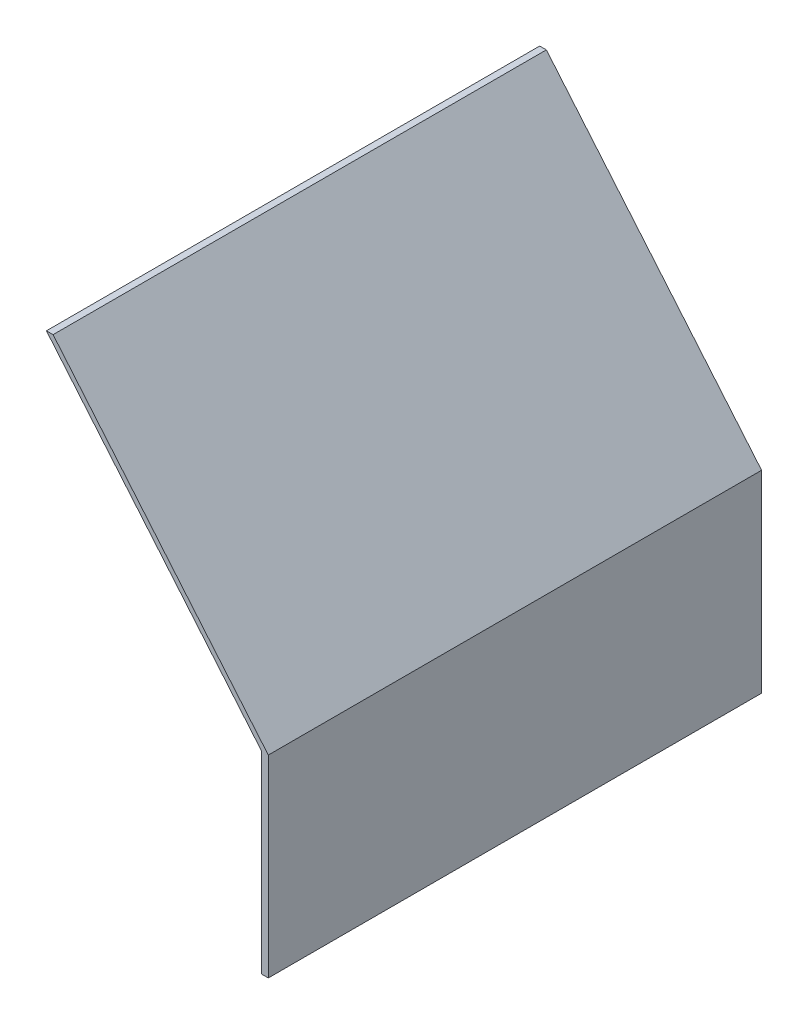
ISO-10303-21;
HEADER;
FILE_DESCRIPTION(('STEP AP214'),'2;1');
FILE_NAME('part.step','',(''),(''),'','','');
FILE_SCHEMA(('AUTOMOTIVE_DESIGN { 1 0 10303 214 1 1 1 1 }'));
ENDSEC;
DATA;
#1=APPLICATION_CONTEXT('core data for automotive mechanical design processes');
#2=APPLICATION_PROTOCOL_DEFINITION('international standard','automotive_design',2000,#1);
#3=PRODUCT_CONTEXT('',#1,'mechanical');
#4=PRODUCT('Part','Part','',(#3));
#5=PRODUCT_RELATED_PRODUCT_CATEGORY('part','',(#4));
#6=PRODUCT_DEFINITION_FORMATION('','',#4);
#7=PRODUCT_DEFINITION_CONTEXT('part definition',#1,'design');
#8=PRODUCT_DEFINITION('design','',#6,#7);
#9=PRODUCT_DEFINITION_SHAPE('','',#8);
#10=(LENGTH_UNIT() NAMED_UNIT(*) SI_UNIT(.MILLI.,.METRE.));
#11=(NAMED_UNIT(*) PLANE_ANGLE_UNIT() SI_UNIT($,.RADIAN.));
#12=(NAMED_UNIT(*) SI_UNIT($,.STERADIAN.) SOLID_ANGLE_UNIT());
#13=UNCERTAINTY_MEASURE_WITH_UNIT(LENGTH_MEASURE(1.E-05),#10,'distance_accuracy_value','');
#14=(GEOMETRIC_REPRESENTATION_CONTEXT(3) GLOBAL_UNCERTAINTY_ASSIGNED_CONTEXT((#13)) GLOBAL_UNIT_ASSIGNED_CONTEXT((#10,
#11,#12)) REPRESENTATION_CONTEXT('',''));
#15=CARTESIAN_POINT('',(0.,0.,0.));
#16=DIRECTION('',(0.,0.,1.));
#17=DIRECTION('',(1.,0.,0.));
#18=AXIS2_PLACEMENT_3D('',#15,#16,#17);
#19=CARTESIAN_POINT('',(0.,43.942,112.268));
#20=DIRECTION('',(-1.,0.,0.));
#21=DIRECTION('',(0.,-1.,0.));
#22=AXIS2_PLACEMENT_3D('',#19,#20,#21);
#23=PLANE('',#22);
#24=DIRECTION('',(0.,1.,0.));
#25=VECTOR('',#24,1.);
#26=CARTESIAN_POINT('',(0.,43.942,0.));
#27=LINE('',#26,#25);
#28=CARTESIAN_POINT('',(0.,0.,0.));
#29=VERTEX_POINT('',#28);
#30=CARTESIAN_POINT('',(0.,43.942,0.));
#31=VERTEX_POINT('',#30);
#32=EDGE_CURVE('E118',#29,#31,#27,.T.);
#33=ORIENTED_EDGE('',*,*,#32,.T.);
#34=DIRECTION('',(0.,0.,-1.));
#35=VECTOR('',#34,1.);
#36=CARTESIAN_POINT('',(0.,43.942,112.268));
#37=LINE('',#36,#35);
#38=CARTESIAN_POINT('',(0.,43.942,112.268));
#39=VERTEX_POINT('',#38);
#40=EDGE_CURVE('E11',#39,#31,#37,.T.);
#41=ORIENTED_EDGE('',*,*,#40,.F.);
#42=DIRECTION('',(0.,1.,0.));
#43=VECTOR('',#42,1.);
#44=CARTESIAN_POINT('',(0.,43.942,112.268));
#45=LINE('',#44,#43);
#46=CARTESIAN_POINT('',(0.,0.,112.268));
#47=VERTEX_POINT('',#46);
#48=EDGE_CURVE('E128',#47,#39,#45,.T.);
#49=ORIENTED_EDGE('',*,*,#48,.F.);
#50=DIRECTION('',(0.,0.,-1.));
#51=VECTOR('',#50,1.);
#52=CARTESIAN_POINT('',(0.,0.,112.268));
#53=LINE('',#52,#51);
#54=EDGE_CURVE('E114',#47,#29,#53,.T.);
#55=ORIENTED_EDGE('',*,*,#54,.T.);
#56=EDGE_LOOP('',(#33,#41,#49,#55));
#57=FACE_BOUND('',#56,.T.);
#58=ADVANCED_FACE('F34',(#57),#23,.F.);
#59=CARTESIAN_POINT('',(-48.9804158581144,102.314586565666,112.268));
#60=DIRECTION('',(-0.766044443118977,-0.64278760968654,0.));
#61=DIRECTION('',(0.64278760968654,-0.766044443118977,0.));
#62=AXIS2_PLACEMENT_3D('',#59,#60,#61);
#63=PLANE('',#62);
#64=DIRECTION('',(-0.64278760968654,0.766044443118977,0.));
#65=VECTOR('',#64,1.);
#66=CARTESIAN_POINT('',(-48.9804158581144,102.314586565666,0.));
#67=LINE('',#66,#65);
#68=CARTESIAN_POINT('',(-48.9804158581144,102.314586565666,0.));
#69=VERTEX_POINT('',#68);
#70=EDGE_CURVE('E121',#31,#69,#67,.T.);
#71=ORIENTED_EDGE('',*,*,#70,.T.);
#72=DIRECTION('',(0.,0.,-1.));
#73=VECTOR('',#72,1.);
#74=CARTESIAN_POINT('',(-48.9804158581144,102.314586565666,112.268));
#75=LINE('',#74,#73);
#76=CARTESIAN_POINT('',(-48.9804158581144,102.314586565666,112.268));
#77=VERTEX_POINT('',#76);
#78=EDGE_CURVE('E42',#77,#69,#75,.T.);
#79=ORIENTED_EDGE('',*,*,#78,.F.);
#80=DIRECTION('',(-0.64278760968654,0.766044443118977,0.));
#81=VECTOR('',#80,1.);
#82=CARTESIAN_POINT('',(-48.9804158581144,102.314586565666,112.268));
#83=LINE('',#82,#81);
#84=EDGE_CURVE('E87',#39,#77,#83,.T.);
#85=ORIENTED_EDGE('',*,*,#84,.F.);
#86=ORIENTED_EDGE('',*,*,#40,.T.);
#87=EDGE_LOOP('',(#71,#79,#85,#86));
#88=FACE_BOUND('',#87,.T.);
#89=ADVANCED_FACE('F152',(#88),#63,.F.);
#90=CARTESIAN_POINT('',(-50.4993358581144,102.314586565666,112.268));
#91=DIRECTION('',(0.,-1.,0.));
#92=DIRECTION('',(1.,0.,0.));
#93=AXIS2_PLACEMENT_3D('',#90,#91,#92);
#94=PLANE('',#93);
#95=DIRECTION('',(-1.,0.,0.));
#96=VECTOR('',#95,1.);
#97=CARTESIAN_POINT('',(-50.4993358581144,102.314586565666,0.));
#98=LINE('',#97,#96);
#99=CARTESIAN_POINT('',(-50.4993358581144,102.314586565666,0.));
#100=VERTEX_POINT('',#99);
#101=EDGE_CURVE('E123',#69,#100,#98,.T.);
#102=ORIENTED_EDGE('',*,*,#101,.T.);
#103=DIRECTION('',(0.,0.,-1.));
#104=VECTOR('',#103,1.);
#105=CARTESIAN_POINT('',(-50.4993358581144,102.314586565666,112.268));
#106=LINE('',#105,#104);
#107=CARTESIAN_POINT('',(-50.4993358581144,102.314586565666,112.268));
#108=VERTEX_POINT('',#107);
#109=EDGE_CURVE('E109',#108,#100,#106,.T.);
#110=ORIENTED_EDGE('',*,*,#109,.F.);
#111=DIRECTION('',(-1.,0.,0.));
#112=VECTOR('',#111,1.);
#113=CARTESIAN_POINT('',(-50.4993358581144,102.314586565666,112.268));
#114=LINE('',#113,#112);
#115=EDGE_CURVE('E100',#77,#108,#114,.T.);
#116=ORIENTED_EDGE('',*,*,#115,.F.);
#117=ORIENTED_EDGE('',*,*,#78,.T.);
#118=EDGE_LOOP('',(#102,#110,#116,#117));
#119=FACE_BOUND('',#118,.T.);
#120=ADVANCED_FACE('F134',(#119),#94,.F.);
#121=CARTESIAN_POINT('',(-1.51892,43.942,112.268));
#122=DIRECTION('',(0.766044443118977,0.64278760968654,0.));
#123=DIRECTION('',(-0.64278760968654,0.766044443118977,0.));
#124=AXIS2_PLACEMENT_3D('',#121,#122,#123);
#125=PLANE('',#124);
#126=DIRECTION('',(0.64278760968654,-0.766044443118977,0.));
#127=VECTOR('',#126,1.);
#128=CARTESIAN_POINT('',(-1.51892,43.942,0.));
#129=LINE('',#128,#127);
#130=CARTESIAN_POINT('',(-1.51892,43.942,0.));
#131=VERTEX_POINT('',#130);
#132=EDGE_CURVE('E108',#100,#131,#129,.T.);
#133=ORIENTED_EDGE('',*,*,#132,.T.);
#134=DIRECTION('',(0.,0.,-1.));
#135=VECTOR('',#134,1.);
#136=CARTESIAN_POINT('',(-1.51892,43.942,112.268));
#137=LINE('',#136,#135);
#138=CARTESIAN_POINT('',(-1.51892,43.942,112.268));
#139=VERTEX_POINT('',#138);
#140=EDGE_CURVE('E105',#139,#131,#137,.T.);
#141=ORIENTED_EDGE('',*,*,#140,.F.);
#142=DIRECTION('',(0.64278760968654,-0.766044443118977,0.));
#143=VECTOR('',#142,1.);
#144=CARTESIAN_POINT('',(-1.51892,43.942,112.268));
#145=LINE('',#144,#143);
#146=EDGE_CURVE('E94',#108,#139,#145,.T.);
#147=ORIENTED_EDGE('',*,*,#146,.F.);
#148=ORIENTED_EDGE('',*,*,#109,.T.);
#149=EDGE_LOOP('',(#133,#141,#147,#148));
#150=FACE_BOUND('',#149,.T.);
#151=ADVANCED_FACE('F106',(#150),#125,.F.);
#152=CARTESIAN_POINT('',(-1.51892,0.,112.268));
#153=DIRECTION('',(1.,0.,0.));
#154=DIRECTION('',(0.,0.,-1.));
#155=AXIS2_PLACEMENT_3D('',#152,#153,#154);
#156=PLANE('',#155);
#157=DIRECTION('',(0.,-1.,0.));
#158=VECTOR('',#157,1.);
#159=CARTESIAN_POINT('',(-1.51892,0.,0.));
#160=LINE('',#159,#158);
#161=CARTESIAN_POINT('',(-1.51892,0.,0.));
#162=VERTEX_POINT('',#161);
#163=EDGE_CURVE('E73',#131,#162,#160,.T.);
#164=ORIENTED_EDGE('',*,*,#163,.T.);
#165=DIRECTION('',(0.,0.,-1.));
#166=VECTOR('',#165,1.);
#167=CARTESIAN_POINT('',(-1.51892,0.,112.268));
#168=LINE('',#167,#166);
#169=CARTESIAN_POINT('',(-1.51892,0.,112.268));
#170=VERTEX_POINT('',#169);
#171=EDGE_CURVE('E110',#170,#162,#168,.T.);
#172=ORIENTED_EDGE('',*,*,#171,.F.);
#173=DIRECTION('',(0.,-1.,0.));
#174=VECTOR('',#173,1.);
#175=CARTESIAN_POINT('',(-1.51892,0.,112.268));
#176=LINE('',#175,#174);
#177=EDGE_CURVE('E98',#139,#170,#176,.T.);
#178=ORIENTED_EDGE('',*,*,#177,.F.);
#179=ORIENTED_EDGE('',*,*,#140,.T.);
#180=EDGE_LOOP('',(#164,#172,#178,#179));
#181=FACE_BOUND('',#180,.T.);
#182=ADVANCED_FACE('F112',(#181),#156,.F.);
#183=CARTESIAN_POINT('',(0.,0.,112.268));
#184=DIRECTION('',(0.,1.,0.));
#185=DIRECTION('',(0.,0.,1.));
#186=AXIS2_PLACEMENT_3D('',#183,#184,#185);
#187=PLANE('',#186);
#188=DIRECTION('',(1.,0.,0.));
#189=VECTOR('',#188,1.);
#190=CARTESIAN_POINT('',(0.,0.,0.));
#191=LINE('',#190,#189);
#192=EDGE_CURVE('E79',#162,#29,#191,.T.);
#193=ORIENTED_EDGE('',*,*,#192,.T.);
#194=ORIENTED_EDGE('',*,*,#54,.F.);
#195=DIRECTION('',(1.,0.,0.));
#196=VECTOR('',#195,1.);
#197=CARTESIAN_POINT('',(0.,0.,112.268));
#198=LINE('',#197,#196);
#199=EDGE_CURVE('E50',#170,#47,#198,.T.);
#200=ORIENTED_EDGE('',*,*,#199,.F.);
#201=ORIENTED_EDGE('',*,*,#171,.T.);
#202=EDGE_LOOP('',(#193,#194,#200,#201));
#203=FACE_BOUND('',#202,.T.);
#204=ADVANCED_FACE('F141',(#203),#187,.F.);
#205=CARTESIAN_POINT('',(0.,0.,112.268));
#206=DIRECTION('',(0.,0.,-1.));
#207=DIRECTION('',(-1.,0.,0.));
#208=AXIS2_PLACEMENT_3D('',#205,#206,#207);
#209=PLANE('',#208);
#210=ORIENTED_EDGE('',*,*,#48,.T.);
#211=ORIENTED_EDGE('',*,*,#84,.T.);
#212=ORIENTED_EDGE('',*,*,#115,.T.);
#213=ORIENTED_EDGE('',*,*,#146,.T.);
#214=ORIENTED_EDGE('',*,*,#177,.T.);
#215=ORIENTED_EDGE('',*,*,#199,.T.);
#216=EDGE_LOOP('',(#210,#211,#212,#213,#214,#215));
#217=FACE_BOUND('',#216,.T.);
#218=ADVANCED_FACE('F96',(#217),#209,.F.);
#219=CARTESIAN_POINT('',(0.,0.,0.));
#220=DIRECTION('',(0.,0.,-1.));
#221=DIRECTION('',(-1.,0.,0.));
#222=AXIS2_PLACEMENT_3D('',#219,#220,#221);
#223=PLANE('',#222);
#224=ORIENTED_EDGE('',*,*,#32,.F.);
#225=ORIENTED_EDGE('',*,*,#192,.F.);
#226=ORIENTED_EDGE('',*,*,#163,.F.);
#227=ORIENTED_EDGE('',*,*,#132,.F.);
#228=ORIENTED_EDGE('',*,*,#101,.F.);
#229=ORIENTED_EDGE('',*,*,#70,.F.);
#230=EDGE_LOOP('',(#224,#225,#226,#227,#228,#229));
#231=FACE_BOUND('',#230,.T.);
#232=ADVANCED_FACE('F137',(#231),#223,.T.);
#233=CLOSED_SHELL('',(#58,#89,#120,#151,#182,#204,#218,#232));
#234=MANIFOLD_SOLID_BREP('B2',#233);
#235=ADVANCED_BREP_SHAPE_REPRESENTATION('',(#18,#234),#14);
#236=SHAPE_DEFINITION_REPRESENTATION(#9,#235);
ENDSEC;
END-ISO-10303-21;
